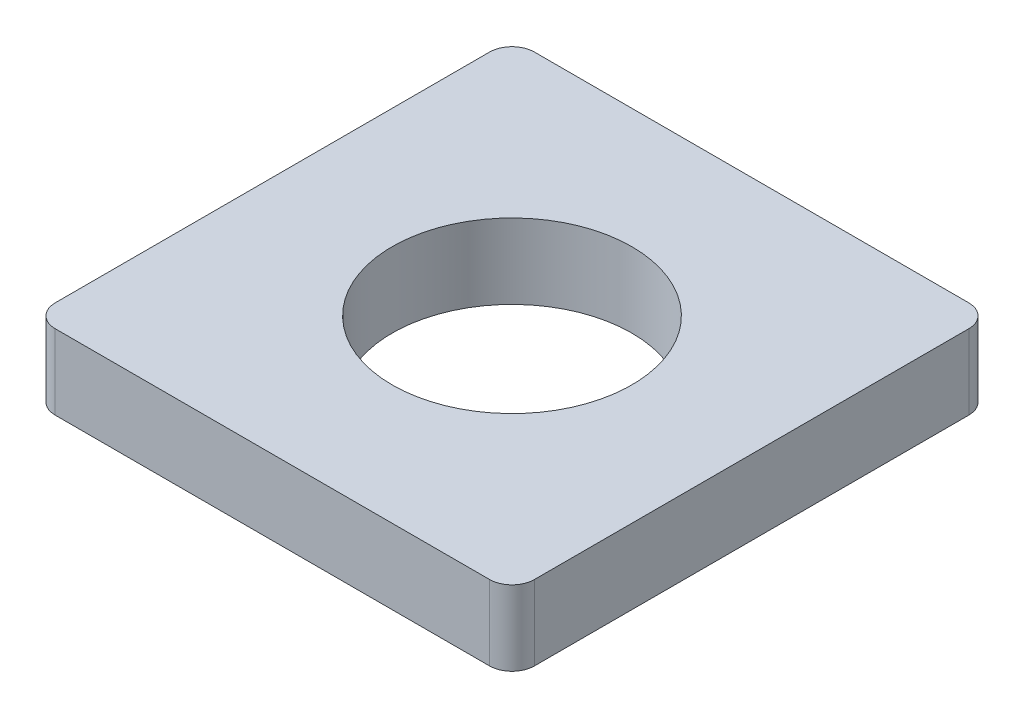
ISO-10303-21;
HEADER;
FILE_DESCRIPTION(('STEP AP214'),'2;1');
FILE_NAME('part.step','',(''),(''),'','','');
FILE_SCHEMA(('AUTOMOTIVE_DESIGN { 1 0 10303 214 1 1 1 1 }'));
ENDSEC;
DATA;
#1=APPLICATION_CONTEXT('core data for automotive mechanical design processes');
#2=APPLICATION_PROTOCOL_DEFINITION('international standard','automotive_design',2000,#1);
#3=PRODUCT_CONTEXT('',#1,'mechanical');
#4=PRODUCT('Part','Part','',(#3));
#5=PRODUCT_RELATED_PRODUCT_CATEGORY('part','',(#4));
#6=PRODUCT_DEFINITION_FORMATION('','',#4);
#7=PRODUCT_DEFINITION_CONTEXT('part definition',#1,'design');
#8=PRODUCT_DEFINITION('design','',#6,#7);
#9=PRODUCT_DEFINITION_SHAPE('','',#8);
#10=(LENGTH_UNIT() NAMED_UNIT(*) SI_UNIT(.MILLI.,.METRE.));
#11=(NAMED_UNIT(*) PLANE_ANGLE_UNIT() SI_UNIT($,.RADIAN.));
#12=(NAMED_UNIT(*) SI_UNIT($,.STERADIAN.) SOLID_ANGLE_UNIT());
#13=UNCERTAINTY_MEASURE_WITH_UNIT(LENGTH_MEASURE(1.E-05),#10,'distance_accuracy_value','');
#14=(GEOMETRIC_REPRESENTATION_CONTEXT(3) GLOBAL_UNCERTAINTY_ASSIGNED_CONTEXT((#13)) GLOBAL_UNIT_ASSIGNED_CONTEXT((#10,
#11,#12)) REPRESENTATION_CONTEXT('',''));
#15=CARTESIAN_POINT('',(0.,0.,0.));
#16=DIRECTION('',(0.,0.,1.));
#17=DIRECTION('',(1.,0.,0.));
#18=AXIS2_PLACEMENT_3D('',#15,#16,#17);
#19=CARTESIAN_POINT('',(-3.2,0.,-3.2));
#20=DIRECTION('',(-1.,0.,0.));
#21=DIRECTION('',(0.,0.,1.));
#22=AXIS2_PLACEMENT_3D('',#19,#20,#21);
#23=PLANE('',#22);
#24=DIRECTION('',(0.,0.,1.));
#25=VECTOR('',#24,1.);
#26=CARTESIAN_POINT('',(-3.2,1.,0.));
#27=LINE('',#26,#25);
#28=CARTESIAN_POINT('',(-3.2,1.,-2.9));
#29=VERTEX_POINT('',#28);
#30=CARTESIAN_POINT('',(-3.2,1.,2.9));
#31=VERTEX_POINT('',#30);
#32=EDGE_CURVE('E107',#29,#31,#27,.T.);
#33=ORIENTED_EDGE('',*,*,#32,.F.);
#34=DIRECTION('',(0.,-1.,0.));
#35=VECTOR('',#34,1.);
#36=CARTESIAN_POINT('',(-3.2,0.,-2.9));
#37=LINE('',#36,#35);
#38=CARTESIAN_POINT('',(-3.2,0.,-2.9));
#39=VERTEX_POINT('',#38);
#40=EDGE_CURVE('E119',#29,#39,#37,.T.);
#41=ORIENTED_EDGE('',*,*,#40,.T.);
#42=DIRECTION('',(0.,0.,1.));
#43=VECTOR('',#42,1.);
#44=CARTESIAN_POINT('',(-3.2,0.,-3.2));
#45=LINE('',#44,#43);
#46=CARTESIAN_POINT('',(-3.2,0.,2.9));
#47=VERTEX_POINT('',#46);
#48=EDGE_CURVE('E160',#39,#47,#45,.T.);
#49=ORIENTED_EDGE('',*,*,#48,.T.);
#50=DIRECTION('',(0.,-1.,0.));
#51=VECTOR('',#50,1.);
#52=CARTESIAN_POINT('',(-3.2,0.,2.9));
#53=LINE('',#52,#51);
#54=EDGE_CURVE('E122',#47,#31,#53,.F.);
#55=ORIENTED_EDGE('',*,*,#54,.T.);
#56=EDGE_LOOP('',(#33,#41,#49,#55));
#57=FACE_BOUND('',#56,.T.);
#58=ADVANCED_FACE('F40',(#57),#23,.T.);
#59=CARTESIAN_POINT('',(-3.2,0.,-3.2));
#60=DIRECTION('',(0.,0.,-1.));
#61=DIRECTION('',(-1.,0.,0.));
#62=AXIS2_PLACEMENT_3D('',#59,#60,#61);
#63=PLANE('',#62);
#64=DIRECTION('',(-1.,0.,0.));
#65=VECTOR('',#64,1.);
#66=CARTESIAN_POINT('',(-3.2,0.,-3.2));
#67=LINE('',#66,#65);
#68=CARTESIAN_POINT('',(2.9,0.,-3.2));
#69=VERTEX_POINT('',#68);
#70=CARTESIAN_POINT('',(-2.9,0.,-3.2));
#71=VERTEX_POINT('',#70);
#72=EDGE_CURVE('E131',#69,#71,#67,.T.);
#73=ORIENTED_EDGE('',*,*,#72,.T.);
#74=DIRECTION('',(0.,-1.,0.));
#75=VECTOR('',#74,1.);
#76=CARTESIAN_POINT('',(-2.9,0.,-3.2));
#77=LINE('',#76,#75);
#78=CARTESIAN_POINT('',(-2.9,1.,-3.2));
#79=VERTEX_POINT('',#78);
#80=EDGE_CURVE('E142',#71,#79,#77,.F.);
#81=ORIENTED_EDGE('',*,*,#80,.T.);
#82=DIRECTION('',(1.,0.,0.));
#83=VECTOR('',#82,1.);
#84=CARTESIAN_POINT('',(0.,1.,-3.2));
#85=LINE('',#84,#83);
#86=CARTESIAN_POINT('',(2.9,1.,-3.2));
#87=VERTEX_POINT('',#86);
#88=EDGE_CURVE('E109',#87,#79,#85,.F.);
#89=ORIENTED_EDGE('',*,*,#88,.F.);
#90=DIRECTION('',(0.,-1.,0.));
#91=VECTOR('',#90,1.);
#92=CARTESIAN_POINT('',(2.9,0.,-3.2));
#93=LINE('',#92,#91);
#94=EDGE_CURVE('E139',#87,#69,#93,.T.);
#95=ORIENTED_EDGE('',*,*,#94,.T.);
#96=EDGE_LOOP('',(#73,#81,#89,#95));
#97=FACE_BOUND('',#96,.T.);
#98=ADVANCED_FACE('F191',(#97),#63,.T.);
#99=CARTESIAN_POINT('',(3.2,0.,-3.2));
#100=DIRECTION('',(1.,0.,0.));
#101=DIRECTION('',(0.,0.,-1.));
#102=AXIS2_PLACEMENT_3D('',#99,#100,#101);
#103=PLANE('',#102);
#104=DIRECTION('',(0.,0.,-1.));
#105=VECTOR('',#104,1.);
#106=CARTESIAN_POINT('',(3.2,0.,-3.2));
#107=LINE('',#106,#105);
#108=CARTESIAN_POINT('',(3.2,0.,2.9));
#109=VERTEX_POINT('',#108);
#110=CARTESIAN_POINT('',(3.2,0.,-2.9));
#111=VERTEX_POINT('',#110);
#112=EDGE_CURVE('E161',#109,#111,#107,.T.);
#113=ORIENTED_EDGE('',*,*,#112,.T.);
#114=DIRECTION('',(0.,-1.,0.));
#115=VECTOR('',#114,1.);
#116=CARTESIAN_POINT('',(3.2,0.,-2.9));
#117=LINE('',#116,#115);
#118=CARTESIAN_POINT('',(3.2,1.,-2.9));
#119=VERTEX_POINT('',#118);
#120=EDGE_CURVE('E150',#111,#119,#117,.F.);
#121=ORIENTED_EDGE('',*,*,#120,.T.);
#122=DIRECTION('',(0.,0.,1.));
#123=VECTOR('',#122,1.);
#124=CARTESIAN_POINT('',(3.2,1.,0.));
#125=LINE('',#124,#123);
#126=CARTESIAN_POINT('',(3.2,1.,2.9));
#127=VERTEX_POINT('',#126);
#128=EDGE_CURVE('E174',#127,#119,#125,.F.);
#129=ORIENTED_EDGE('',*,*,#128,.F.);
#130=DIRECTION('',(0.,-1.,0.));
#131=VECTOR('',#130,1.);
#132=CARTESIAN_POINT('',(3.2,0.,2.9));
#133=LINE('',#132,#131);
#134=EDGE_CURVE('E113',#127,#109,#133,.T.);
#135=ORIENTED_EDGE('',*,*,#134,.T.);
#136=EDGE_LOOP('',(#113,#121,#129,#135));
#137=FACE_BOUND('',#136,.T.);
#138=ADVANCED_FACE('F183',(#137),#103,.T.);
#139=CARTESIAN_POINT('',(0.,0.,0.));
#140=DIRECTION('',(0.,1.,0.));
#141=DIRECTION('',(0.,0.,1.));
#142=AXIS2_PLACEMENT_3D('',#139,#140,#141);
#143=CYLINDRICAL_SURFACE('',#142,1.6);
#144=CARTESIAN_POINT('',(0.,0.,0.));
#145=DIRECTION('',(0.,1.,0.));
#146=DIRECTION('',(0.,0.,1.));
#147=AXIS2_PLACEMENT_3D('',#144,#145,#146);
#148=CIRCLE('',#147,1.6);
#149=CARTESIAN_POINT('',(0.,0.,1.6));
#150=VERTEX_POINT('',#149);
#151=EDGE_CURVE('E165',#150,#150,#148,.T.);
#152=ORIENTED_EDGE('',*,*,#151,.F.);
#153=EDGE_LOOP('',(#152));
#154=FACE_BOUND('',#153,.T.);
#155=CARTESIAN_POINT('',(0.,1.,0.));
#156=DIRECTION('',(0.,1.,0.));
#157=DIRECTION('',(0.,0.,1.));
#158=AXIS2_PLACEMENT_3D('',#155,#156,#157);
#159=CIRCLE('',#158,1.6);
#160=CARTESIAN_POINT('',(0.,1.,1.6));
#161=VERTEX_POINT('',#160);
#162=EDGE_CURVE('E171',#161,#161,#159,.T.);
#163=ORIENTED_EDGE('',*,*,#162,.T.);
#164=EDGE_LOOP('',(#163));
#165=FACE_BOUND('',#164,.T.);
#166=ADVANCED_FACE('F198',(#154,#165),#143,.F.);
#167=CARTESIAN_POINT('',(-3.2,0.,3.2));
#168=DIRECTION('',(0.,0.,1.));
#169=DIRECTION('',(1.,0.,0.));
#170=AXIS2_PLACEMENT_3D('',#167,#168,#169);
#171=PLANE('',#170);
#172=DIRECTION('',(1.,0.,0.));
#173=VECTOR('',#172,1.);
#174=CARTESIAN_POINT('',(-3.2,0.,3.2));
#175=LINE('',#174,#173);
#176=CARTESIAN_POINT('',(-2.9,0.,3.2));
#177=VERTEX_POINT('',#176);
#178=CARTESIAN_POINT('',(2.9,0.,3.2));
#179=VERTEX_POINT('',#178);
#180=EDGE_CURVE('E155',#177,#179,#175,.T.);
#181=ORIENTED_EDGE('',*,*,#180,.T.);
#182=DIRECTION('',(0.,-1.,0.));
#183=VECTOR('',#182,1.);
#184=CARTESIAN_POINT('',(2.9,0.,3.2));
#185=LINE('',#184,#183);
#186=CARTESIAN_POINT('',(2.9,1.,3.2));
#187=VERTEX_POINT('',#186);
#188=EDGE_CURVE('E11',#179,#187,#185,.F.);
#189=ORIENTED_EDGE('',*,*,#188,.T.);
#190=DIRECTION('',(1.,0.,0.));
#191=VECTOR('',#190,1.);
#192=CARTESIAN_POINT('',(0.,1.,3.2));
#193=LINE('',#192,#191);
#194=CARTESIAN_POINT('',(-2.9,1.,3.2));
#195=VERTEX_POINT('',#194);
#196=EDGE_CURVE('E123',#195,#187,#193,.T.);
#197=ORIENTED_EDGE('',*,*,#196,.F.);
#198=DIRECTION('',(0.,-1.,0.));
#199=VECTOR('',#198,1.);
#200=CARTESIAN_POINT('',(-2.9,0.,3.2));
#201=LINE('',#200,#199);
#202=EDGE_CURVE('E48',#195,#177,#201,.T.);
#203=ORIENTED_EDGE('',*,*,#202,.T.);
#204=EDGE_LOOP('',(#181,#189,#197,#203));
#205=FACE_BOUND('',#204,.T.);
#206=ADVANCED_FACE('F154',(#205),#171,.T.);
#207=CARTESIAN_POINT('',(0.,0.,0.));
#208=DIRECTION('',(0.,1.,0.));
#209=DIRECTION('',(0.,0.,1.));
#210=AXIS2_PLACEMENT_3D('',#207,#208,#209);
#211=PLANE('',#210);
#212=ORIENTED_EDGE('',*,*,#151,.T.);
#213=EDGE_LOOP('',(#212));
#214=FACE_BOUND('',#213,.T.);
#215=ORIENTED_EDGE('',*,*,#48,.F.);
#216=CARTESIAN_POINT('',(-2.9,0.,-2.9));
#217=DIRECTION('',(0.,1.,0.));
#218=DIRECTION('',(0.,0.,1.));
#219=AXIS2_PLACEMENT_3D('',#216,#217,#218);
#220=CIRCLE('',#219,0.3);
#221=EDGE_CURVE('E126',#39,#71,#220,.F.);
#222=ORIENTED_EDGE('',*,*,#221,.T.);
#223=ORIENTED_EDGE('',*,*,#72,.F.);
#224=CARTESIAN_POINT('',(2.9,0.,-2.9));
#225=DIRECTION('',(0.,1.,0.));
#226=DIRECTION('',(0.,0.,1.));
#227=AXIS2_PLACEMENT_3D('',#224,#225,#226);
#228=CIRCLE('',#227,0.3);
#229=EDGE_CURVE('E136',#69,#111,#228,.F.);
#230=ORIENTED_EDGE('',*,*,#229,.T.);
#231=ORIENTED_EDGE('',*,*,#112,.F.);
#232=CARTESIAN_POINT('',(2.9,0.,2.9));
#233=DIRECTION('',(0.,1.,0.));
#234=DIRECTION('',(0.,0.,1.));
#235=AXIS2_PLACEMENT_3D('',#232,#233,#234);
#236=CIRCLE('',#235,0.3);
#237=EDGE_CURVE('E129',#109,#179,#236,.F.);
#238=ORIENTED_EDGE('',*,*,#237,.T.);
#239=ORIENTED_EDGE('',*,*,#180,.F.);
#240=CARTESIAN_POINT('',(-2.9,0.,2.9));
#241=DIRECTION('',(0.,1.,0.));
#242=DIRECTION('',(0.,0.,1.));
#243=AXIS2_PLACEMENT_3D('',#240,#241,#242);
#244=CIRCLE('',#243,0.3);
#245=EDGE_CURVE('E127',#177,#47,#244,.F.);
#246=ORIENTED_EDGE('',*,*,#245,.T.);
#247=EDGE_LOOP('',(#215,#222,#223,#230,#231,#238,#239,#246));
#248=FACE_BOUND('',#247,.T.);
#249=ADVANCED_FACE('F158',(#214,#248),#211,.F.);
#250=CARTESIAN_POINT('',(0.,1.,0.));
#251=DIRECTION('',(0.,1.,0.));
#252=DIRECTION('',(0.,0.,1.));
#253=AXIS2_PLACEMENT_3D('',#250,#251,#252);
#254=PLANE('',#253);
#255=ORIENTED_EDGE('',*,*,#162,.F.);
#256=EDGE_LOOP('',(#255));
#257=FACE_BOUND('',#256,.T.);
#258=ORIENTED_EDGE('',*,*,#88,.T.);
#259=CARTESIAN_POINT('',(-2.9,1.,-2.9));
#260=DIRECTION('',(0.,1.,0.));
#261=DIRECTION('',(0.,0.,1.));
#262=AXIS2_PLACEMENT_3D('',#259,#260,#261);
#263=CIRCLE('',#262,0.3);
#264=EDGE_CURVE('E104',#79,#29,#263,.T.);
#265=ORIENTED_EDGE('',*,*,#264,.T.);
#266=ORIENTED_EDGE('',*,*,#32,.T.);
#267=CARTESIAN_POINT('',(-2.9,1.,2.9));
#268=DIRECTION('',(0.,1.,0.));
#269=DIRECTION('',(0.,0.,1.));
#270=AXIS2_PLACEMENT_3D('',#267,#268,#269);
#271=CIRCLE('',#270,0.3);
#272=EDGE_CURVE('E60',#31,#195,#271,.T.);
#273=ORIENTED_EDGE('',*,*,#272,.T.);
#274=ORIENTED_EDGE('',*,*,#196,.T.);
#275=CARTESIAN_POINT('',(2.9,1.,2.9));
#276=DIRECTION('',(0.,1.,0.));
#277=DIRECTION('',(0.,0.,1.));
#278=AXIS2_PLACEMENT_3D('',#275,#276,#277);
#279=CIRCLE('',#278,0.3);
#280=EDGE_CURVE('E145',#187,#127,#279,.T.);
#281=ORIENTED_EDGE('',*,*,#280,.T.);
#282=ORIENTED_EDGE('',*,*,#128,.T.);
#283=CARTESIAN_POINT('',(2.9,1.,-2.9));
#284=DIRECTION('',(0.,1.,0.));
#285=DIRECTION('',(0.,0.,1.));
#286=AXIS2_PLACEMENT_3D('',#283,#284,#285);
#287=CIRCLE('',#286,0.3);
#288=EDGE_CURVE('E114',#119,#87,#287,.T.);
#289=ORIENTED_EDGE('',*,*,#288,.T.);
#290=EDGE_LOOP('',(#258,#265,#266,#273,#274,#281,#282,#289));
#291=FACE_BOUND('',#290,.T.);
#292=ADVANCED_FACE('F106',(#257,#291),#254,.T.);
#293=CARTESIAN_POINT('',(-2.9,0.,-2.9));
#294=DIRECTION('',(0.,-1.,0.));
#295=DIRECTION('',(0.,0.,-1.));
#296=AXIS2_PLACEMENT_3D('',#293,#294,#295);
#297=CYLINDRICAL_SURFACE('',#296,0.3);
#298=ORIENTED_EDGE('',*,*,#264,.F.);
#299=ORIENTED_EDGE('',*,*,#80,.F.);
#300=ORIENTED_EDGE('',*,*,#221,.F.);
#301=ORIENTED_EDGE('',*,*,#40,.F.);
#302=EDGE_LOOP('',(#298,#299,#300,#301));
#303=FACE_BOUND('',#302,.T.);
#304=ADVANCED_FACE('F125',(#303),#297,.T.);
#305=CARTESIAN_POINT('',(2.9,0.,-2.9));
#306=DIRECTION('',(0.,-1.,0.));
#307=DIRECTION('',(0.,0.,-1.));
#308=AXIS2_PLACEMENT_3D('',#305,#306,#307);
#309=CYLINDRICAL_SURFACE('',#308,0.3);
#310=ORIENTED_EDGE('',*,*,#288,.F.);
#311=ORIENTED_EDGE('',*,*,#120,.F.);
#312=ORIENTED_EDGE('',*,*,#229,.F.);
#313=ORIENTED_EDGE('',*,*,#94,.F.);
#314=EDGE_LOOP('',(#310,#311,#312,#313));
#315=FACE_BOUND('',#314,.T.);
#316=ADVANCED_FACE('F189',(#315),#309,.T.);
#317=CARTESIAN_POINT('',(2.9,0.,2.9));
#318=DIRECTION('',(0.,-1.,0.));
#319=DIRECTION('',(0.,0.,-1.));
#320=AXIS2_PLACEMENT_3D('',#317,#318,#319);
#321=CYLINDRICAL_SURFACE('',#320,0.3);
#322=ORIENTED_EDGE('',*,*,#280,.F.);
#323=ORIENTED_EDGE('',*,*,#188,.F.);
#324=ORIENTED_EDGE('',*,*,#237,.F.);
#325=ORIENTED_EDGE('',*,*,#134,.F.);
#326=EDGE_LOOP('',(#322,#323,#324,#325));
#327=FACE_BOUND('',#326,.T.);
#328=ADVANCED_FACE('F181',(#327),#321,.T.);
#329=CARTESIAN_POINT('',(-2.9,0.,2.9));
#330=DIRECTION('',(0.,-1.,0.));
#331=DIRECTION('',(0.,0.,-1.));
#332=AXIS2_PLACEMENT_3D('',#329,#330,#331);
#333=CYLINDRICAL_SURFACE('',#332,0.3);
#334=ORIENTED_EDGE('',*,*,#272,.F.);
#335=ORIENTED_EDGE('',*,*,#54,.F.);
#336=ORIENTED_EDGE('',*,*,#245,.F.);
#337=ORIENTED_EDGE('',*,*,#202,.F.);
#338=EDGE_LOOP('',(#334,#335,#336,#337));
#339=FACE_BOUND('',#338,.T.);
#340=ADVANCED_FACE('F42',(#339),#333,.T.);
#341=CLOSED_SHELL('',(#58,#98,#138,#166,#206,#249,#292,#304,#316,#328,#340));
#342=MANIFOLD_SOLID_BREP('B2',#341);
#343=ADVANCED_BREP_SHAPE_REPRESENTATION('',(#18,#342),#14);
#344=SHAPE_DEFINITION_REPRESENTATION(#9,#343);
ENDSEC;
END-ISO-10303-21;
